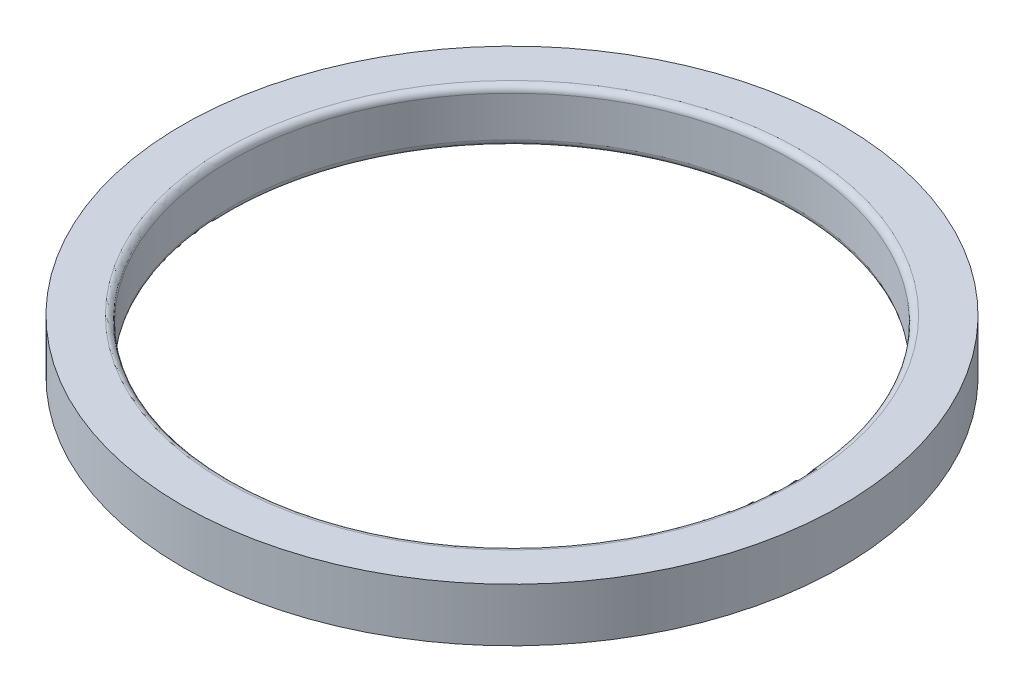
ISO-10303-21;
HEADER;
FILE_DESCRIPTION(('STEP AP214'),'2;1');
FILE_NAME('part.step','',(''),(''),'','','');
FILE_SCHEMA(('AUTOMOTIVE_DESIGN { 1 0 10303 214 1 1 1 1 }'));
ENDSEC;
DATA;
#1=APPLICATION_CONTEXT('core data for automotive mechanical design processes');
#2=APPLICATION_PROTOCOL_DEFINITION('international standard','automotive_design',2000,#1);
#3=PRODUCT_CONTEXT('',#1,'mechanical');
#4=PRODUCT('Part','Part','',(#3));
#5=PRODUCT_RELATED_PRODUCT_CATEGORY('part','',(#4));
#6=PRODUCT_DEFINITION_FORMATION('','',#4);
#7=PRODUCT_DEFINITION_CONTEXT('part definition',#1,'design');
#8=PRODUCT_DEFINITION('design','',#6,#7);
#9=PRODUCT_DEFINITION_SHAPE('','',#8);
#10=(LENGTH_UNIT() NAMED_UNIT(*) SI_UNIT(.MILLI.,.METRE.));
#11=(NAMED_UNIT(*) PLANE_ANGLE_UNIT() SI_UNIT($,.RADIAN.));
#12=(NAMED_UNIT(*) SI_UNIT($,.STERADIAN.) SOLID_ANGLE_UNIT());
#13=UNCERTAINTY_MEASURE_WITH_UNIT(LENGTH_MEASURE(1.E-05),#10,'distance_accuracy_value','');
#14=(GEOMETRIC_REPRESENTATION_CONTEXT(3) GLOBAL_UNCERTAINTY_ASSIGNED_CONTEXT((#13)) GLOBAL_UNIT_ASSIGNED_CONTEXT((#10,
#11,#12)) REPRESENTATION_CONTEXT('',''));
#15=CARTESIAN_POINT('',(0.,0.,0.));
#16=DIRECTION('',(0.,0.,1.));
#17=DIRECTION('',(1.,0.,0.));
#18=AXIS2_PLACEMENT_3D('',#15,#16,#17);
#19=CARTESIAN_POINT('',(0.,1.65,0.));
#20=DIRECTION('',(0.,1.,0.));
#21=DIRECTION('',(0.,0.,1.));
#22=AXIS2_PLACEMENT_3D('',#19,#20,#21);
#23=PLANE('',#22);
#24=CARTESIAN_POINT('',(0.,1.65,0.));
#25=DIRECTION('',(0.,1.,0.));
#26=DIRECTION('',(0.,0.,1.));
#27=AXIS2_PLACEMENT_3D('',#24,#25,#26);
#28=CIRCLE('',#27,8.9);
#29=CARTESIAN_POINT('',(0.,1.65,8.9));
#30=VERTEX_POINT('',#29);
#31=EDGE_CURVE('E38',#30,#30,#28,.F.);
#32=ORIENTED_EDGE('',*,*,#31,.T.);
#33=EDGE_LOOP('',(#32));
#34=FACE_BOUND('',#33,.T.);
#35=CARTESIAN_POINT('',(0.,1.65,0.));
#36=DIRECTION('',(0.,1.,0.));
#37=DIRECTION('',(0.,0.,1.));
#38=AXIS2_PLACEMENT_3D('',#35,#36,#37);
#39=CIRCLE('',#38,10.2);
#40=CARTESIAN_POINT('',(0.,1.65,10.2));
#41=VERTEX_POINT('',#40);
#42=EDGE_CURVE('E51',#41,#41,#39,.T.);
#43=ORIENTED_EDGE('',*,*,#42,.T.);
#44=EDGE_LOOP('',(#43));
#45=FACE_BOUND('',#44,.T.);
#46=ADVANCED_FACE('F31',(#34,#45),#23,.T.);
#47=CARTESIAN_POINT('',(0.,0.,0.));
#48=DIRECTION('',(0.,1.,0.));
#49=DIRECTION('',(0.,0.,1.));
#50=AXIS2_PLACEMENT_3D('',#47,#48,#49);
#51=PLANE('',#50);
#52=CARTESIAN_POINT('',(0.,0.,0.));
#53=DIRECTION('',(0.,1.,0.));
#54=DIRECTION('',(0.,0.,1.));
#55=AXIS2_PLACEMENT_3D('',#52,#53,#54);
#56=CIRCLE('',#55,8.9);
#57=CARTESIAN_POINT('',(0.,0.,8.9));
#58=VERTEX_POINT('',#57);
#59=EDGE_CURVE('E10',#58,#58,#56,.T.);
#60=ORIENTED_EDGE('',*,*,#59,.T.);
#61=EDGE_LOOP('',(#60));
#62=FACE_BOUND('',#61,.T.);
#63=CARTESIAN_POINT('',(0.,0.,0.));
#64=DIRECTION('',(0.,1.,0.));
#65=DIRECTION('',(0.,0.,1.));
#66=AXIS2_PLACEMENT_3D('',#63,#64,#65);
#67=CIRCLE('',#66,10.2);
#68=CARTESIAN_POINT('',(0.,0.,10.2));
#69=VERTEX_POINT('',#68);
#70=EDGE_CURVE('E52',#69,#69,#67,.T.);
#71=ORIENTED_EDGE('',*,*,#70,.F.);
#72=EDGE_LOOP('',(#71));
#73=FACE_BOUND('',#72,.T.);
#74=ADVANCED_FACE('F63',(#62,#73),#51,.F.);
#75=CARTESIAN_POINT('',(0.,1.65,0.));
#76=DIRECTION('',(0.,-1.,0.));
#77=DIRECTION('',(0.,0.,-1.));
#78=AXIS2_PLACEMENT_3D('',#75,#76,#77);
#79=CYLINDRICAL_SURFACE('',#78,10.2);
#80=ORIENTED_EDGE('',*,*,#42,.F.);
#81=EDGE_LOOP('',(#80));
#82=FACE_BOUND('',#81,.T.);
#83=ORIENTED_EDGE('',*,*,#70,.T.);
#84=EDGE_LOOP('',(#83));
#85=FACE_BOUND('',#84,.T.);
#86=ADVANCED_FACE('F59',(#82,#85),#79,.T.);
#87=CARTESIAN_POINT('',(0.,1.65,0.));
#88=DIRECTION('',(0.,-1.,0.));
#89=DIRECTION('',(0.,0.,-1.));
#90=AXIS2_PLACEMENT_3D('',#87,#88,#89);
#91=CYLINDRICAL_SURFACE('',#90,8.7);
#92=CARTESIAN_POINT('',(0.,1.45,0.));
#93=DIRECTION('',(0.,1.,0.));
#94=DIRECTION('',(0.,0.,1.));
#95=AXIS2_PLACEMENT_3D('',#92,#93,#94);
#96=CIRCLE('',#95,8.7);
#97=CARTESIAN_POINT('',(0.,1.45,8.7));
#98=VERTEX_POINT('',#97);
#99=EDGE_CURVE('E42',#98,#98,#96,.T.);
#100=ORIENTED_EDGE('',*,*,#99,.T.);
#101=EDGE_LOOP('',(#100));
#102=FACE_BOUND('',#101,.T.);
#103=CARTESIAN_POINT('',(0.,0.2,0.));
#104=DIRECTION('',(0.,1.,0.));
#105=DIRECTION('',(0.,0.,1.));
#106=AXIS2_PLACEMENT_3D('',#103,#104,#105);
#107=CIRCLE('',#106,8.7);
#108=CARTESIAN_POINT('',(0.,0.2,8.7));
#109=VERTEX_POINT('',#108);
#110=EDGE_CURVE('E46',#109,#109,#107,.F.);
#111=ORIENTED_EDGE('',*,*,#110,.T.);
#112=EDGE_LOOP('',(#111));
#113=FACE_BOUND('',#112,.T.);
#114=ADVANCED_FACE('F62',(#102,#113),#91,.F.);
#115=CARTESIAN_POINT('',(0.,1.45,0.));
#116=DIRECTION('',(0.,1.,0.));
#117=DIRECTION('',(0.,0.,1.));
#118=AXIS2_PLACEMENT_3D('',#115,#116,#117);
#119=TOROIDAL_SURFACE('',#118,8.9,0.2);
#120=ORIENTED_EDGE('',*,*,#31,.F.);
#121=EDGE_LOOP('',(#120));
#122=FACE_BOUND('',#121,.T.);
#123=ORIENTED_EDGE('',*,*,#99,.F.);
#124=EDGE_LOOP('',(#123));
#125=FACE_BOUND('',#124,.T.);
#126=ADVANCED_FACE('F74',(#122,#125),#119,.T.);
#127=CARTESIAN_POINT('',(0.,0.2,0.));
#128=DIRECTION('',(0.,1.,0.));
#129=DIRECTION('',(0.,0.,1.));
#130=AXIS2_PLACEMENT_3D('',#127,#128,#129);
#131=TOROIDAL_SURFACE('',#130,8.9,0.2);
#132=ORIENTED_EDGE('',*,*,#110,.F.);
#133=EDGE_LOOP('',(#132));
#134=FACE_BOUND('',#133,.T.);
#135=ORIENTED_EDGE('',*,*,#59,.F.);
#136=EDGE_LOOP('',(#135));
#137=FACE_BOUND('',#136,.T.);
#138=ADVANCED_FACE('F33',(#134,#137),#131,.T.);
#139=CLOSED_SHELL('',(#46,#74,#86,#114,#126,#138));
#140=MANIFOLD_SOLID_BREP('B2',#139);
#141=ADVANCED_BREP_SHAPE_REPRESENTATION('',(#18,#140),#14);
#142=SHAPE_DEFINITION_REPRESENTATION(#9,#141);
ENDSEC;
END-ISO-10303-21;
